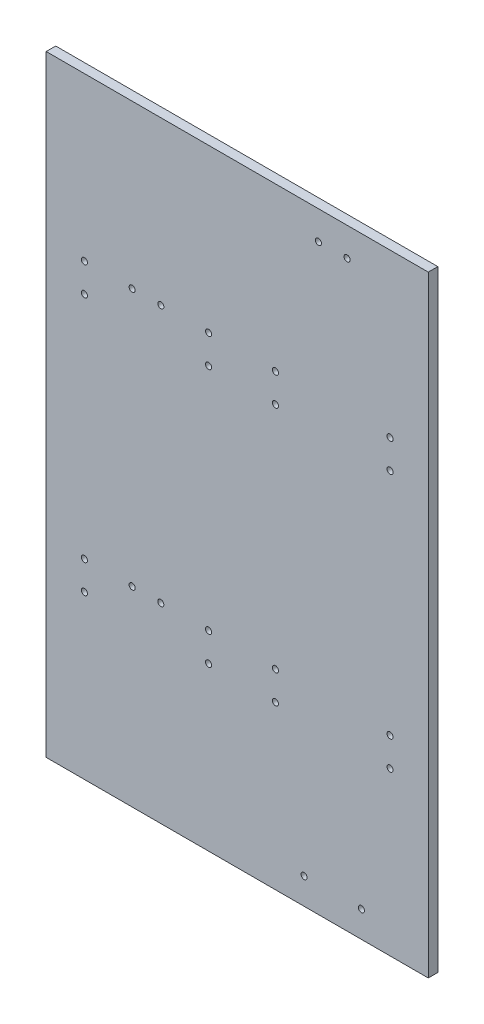
ISO-10303-21;
HEADER;
FILE_DESCRIPTION(('STEP AP214'),'2;1');
FILE_NAME('part.step','',(''),(''),'','','');
FILE_SCHEMA(('AUTOMOTIVE_DESIGN { 1 0 10303 214 1 1 1 1 }'));
ENDSEC;
DATA;
#1=APPLICATION_CONTEXT('core data for automotive mechanical design processes');
#2=APPLICATION_PROTOCOL_DEFINITION('international standard','automotive_design',2000,#1);
#3=PRODUCT_CONTEXT('',#1,'mechanical');
#4=PRODUCT('Part','Part','',(#3));
#5=PRODUCT_RELATED_PRODUCT_CATEGORY('part','',(#4));
#6=PRODUCT_DEFINITION_FORMATION('','',#4);
#7=PRODUCT_DEFINITION_CONTEXT('part definition',#1,'design');
#8=PRODUCT_DEFINITION('design','',#6,#7);
#9=PRODUCT_DEFINITION_SHAPE('','',#8);
#10=(LENGTH_UNIT() NAMED_UNIT(*) SI_UNIT(.MILLI.,.METRE.));
#11=(NAMED_UNIT(*) PLANE_ANGLE_UNIT() SI_UNIT($,.RADIAN.));
#12=(NAMED_UNIT(*) SI_UNIT($,.STERADIAN.) SOLID_ANGLE_UNIT());
#13=UNCERTAINTY_MEASURE_WITH_UNIT(LENGTH_MEASURE(1.E-05),#10,'distance_accuracy_value','');
#14=(GEOMETRIC_REPRESENTATION_CONTEXT(3) GLOBAL_UNCERTAINTY_ASSIGNED_CONTEXT((#13)) GLOBAL_UNIT_ASSIGNED_CONTEXT((#10,
#11,#12)) REPRESENTATION_CONTEXT('',''));
#15=CARTESIAN_POINT('',(0.,0.,0.));
#16=DIRECTION('',(0.,0.,1.));
#17=DIRECTION('',(1.,0.,0.));
#18=AXIS2_PLACEMENT_3D('',#15,#16,#17);
#19=CARTESIAN_POINT('',(100.,-160.,5.));
#20=DIRECTION('',(-1.,0.,0.));
#21=DIRECTION('',(0.,0.,1.));
#22=AXIS2_PLACEMENT_3D('',#19,#20,#21);
#23=PLANE('',#22);
#24=DIRECTION('',(0.,1.,0.));
#25=VECTOR('',#24,1.);
#26=CARTESIAN_POINT('',(100.,-160.,0.));
#27=LINE('',#26,#25);
#28=CARTESIAN_POINT('',(100.,-160.,0.));
#29=VERTEX_POINT('',#28);
#30=CARTESIAN_POINT('',(100.,160.,0.));
#31=VERTEX_POINT('',#30);
#32=EDGE_CURVE('E96',#29,#31,#27,.T.);
#33=ORIENTED_EDGE('',*,*,#32,.T.);
#34=DIRECTION('',(0.,0.,-1.));
#35=VECTOR('',#34,1.);
#36=CARTESIAN_POINT('',(100.,160.,5.));
#37=LINE('',#36,#35);
#38=CARTESIAN_POINT('',(100.,160.,5.));
#39=VERTEX_POINT('',#38);
#40=EDGE_CURVE('E11',#39,#31,#37,.T.);
#41=ORIENTED_EDGE('',*,*,#40,.F.);
#42=DIRECTION('',(0.,1.,0.));
#43=VECTOR('',#42,1.);
#44=CARTESIAN_POINT('',(100.,-160.,5.));
#45=LINE('',#44,#43);
#46=CARTESIAN_POINT('',(100.,-160.,5.));
#47=VERTEX_POINT('',#46);
#48=EDGE_CURVE('E84',#47,#39,#45,.T.);
#49=ORIENTED_EDGE('',*,*,#48,.F.);
#50=DIRECTION('',(0.,0.,-1.));
#51=VECTOR('',#50,1.);
#52=CARTESIAN_POINT('',(100.,-160.,5.));
#53=LINE('',#52,#51);
#54=EDGE_CURVE('E92',#47,#29,#53,.T.);
#55=ORIENTED_EDGE('',*,*,#54,.T.);
#56=EDGE_LOOP('',(#33,#41,#49,#55));
#57=FACE_BOUND('',#56,.T.);
#58=ADVANCED_FACE('F33',(#57),#23,.F.);
#59=CARTESIAN_POINT('',(-100.,160.,5.));
#60=DIRECTION('',(0.,-1.,0.));
#61=DIRECTION('',(0.,0.,-1.));
#62=AXIS2_PLACEMENT_3D('',#59,#60,#61);
#63=PLANE('',#62);
#64=DIRECTION('',(-1.,0.,0.));
#65=VECTOR('',#64,1.);
#66=CARTESIAN_POINT('',(-100.,160.,0.));
#67=LINE('',#66,#65);
#68=CARTESIAN_POINT('',(-100.,160.,0.));
#69=VERTEX_POINT('',#68);
#70=EDGE_CURVE('E88',#31,#69,#67,.T.);
#71=ORIENTED_EDGE('',*,*,#70,.T.);
#72=DIRECTION('',(0.,0.,-1.));
#73=VECTOR('',#72,1.);
#74=CARTESIAN_POINT('',(-100.,160.,5.));
#75=LINE('',#74,#73);
#76=CARTESIAN_POINT('',(-100.,160.,5.));
#77=VERTEX_POINT('',#76);
#78=EDGE_CURVE('E41',#77,#69,#75,.T.);
#79=ORIENTED_EDGE('',*,*,#78,.F.);
#80=DIRECTION('',(-1.,0.,0.));
#81=VECTOR('',#80,1.);
#82=CARTESIAN_POINT('',(-100.,160.,5.));
#83=LINE('',#82,#81);
#84=EDGE_CURVE('E79',#39,#77,#83,.T.);
#85=ORIENTED_EDGE('',*,*,#84,.F.);
#86=ORIENTED_EDGE('',*,*,#40,.T.);
#87=EDGE_LOOP('',(#71,#79,#85,#86));
#88=FACE_BOUND('',#87,.T.);
#89=ADVANCED_FACE('F87',(#88),#63,.F.);
#90=CARTESIAN_POINT('',(-100.,-160.,5.));
#91=DIRECTION('',(1.,0.,0.));
#92=DIRECTION('',(0.,0.,-1.));
#93=AXIS2_PLACEMENT_3D('',#90,#91,#92);
#94=PLANE('',#93);
#95=DIRECTION('',(0.,-1.,0.));
#96=VECTOR('',#95,1.);
#97=CARTESIAN_POINT('',(-100.,-160.,0.));
#98=LINE('',#97,#96);
#99=CARTESIAN_POINT('',(-100.,-160.,0.));
#100=VERTEX_POINT('',#99);
#101=EDGE_CURVE('E66',#69,#100,#98,.T.);
#102=ORIENTED_EDGE('',*,*,#101,.T.);
#103=DIRECTION('',(0.,0.,-1.));
#104=VECTOR('',#103,1.);
#105=CARTESIAN_POINT('',(-100.,-160.,5.));
#106=LINE('',#105,#104);
#107=CARTESIAN_POINT('',(-100.,-160.,5.));
#108=VERTEX_POINT('',#107);
#109=EDGE_CURVE('E89',#108,#100,#106,.T.);
#110=ORIENTED_EDGE('',*,*,#109,.F.);
#111=DIRECTION('',(0.,-1.,0.));
#112=VECTOR('',#111,1.);
#113=CARTESIAN_POINT('',(-100.,-160.,5.));
#114=LINE('',#113,#112);
#115=EDGE_CURVE('E82',#77,#108,#114,.T.);
#116=ORIENTED_EDGE('',*,*,#115,.F.);
#117=ORIENTED_EDGE('',*,*,#78,.T.);
#118=EDGE_LOOP('',(#102,#110,#116,#117));
#119=FACE_BOUND('',#118,.T.);
#120=ADVANCED_FACE('F90',(#119),#94,.F.);
#121=CARTESIAN_POINT('',(-100.,-160.,5.));
#122=DIRECTION('',(0.,1.,0.));
#123=DIRECTION('',(0.,0.,1.));
#124=AXIS2_PLACEMENT_3D('',#121,#122,#123);
#125=PLANE('',#124);
#126=DIRECTION('',(1.,0.,0.));
#127=VECTOR('',#126,1.);
#128=CARTESIAN_POINT('',(-100.,-160.,0.));
#129=LINE('',#128,#127);
#130=EDGE_CURVE('E72',#100,#29,#129,.T.);
#131=ORIENTED_EDGE('',*,*,#130,.T.);
#132=ORIENTED_EDGE('',*,*,#54,.F.);
#133=DIRECTION('',(1.,0.,0.));
#134=VECTOR('',#133,1.);
#135=CARTESIAN_POINT('',(-100.,-160.,5.));
#136=LINE('',#135,#134);
#137=EDGE_CURVE('E49',#108,#47,#136,.T.);
#138=ORIENTED_EDGE('',*,*,#137,.F.);
#139=ORIENTED_EDGE('',*,*,#109,.T.);
#140=EDGE_LOOP('',(#131,#132,#138,#139));
#141=FACE_BOUND('',#140,.T.);
#142=ADVANCED_FACE('F104',(#141),#125,.F.);
#143=CARTESIAN_POINT('',(0.,0.,5.));
#144=DIRECTION('',(0.,0.,-1.));
#145=DIRECTION('',(-1.,0.,0.));
#146=AXIS2_PLACEMENT_3D('',#143,#144,#145);
#147=PLANE('',#146);
#148=CARTESIAN_POINT('',(65.,-146.25,5.));
#149=DIRECTION('',(0.,0.,-1.));
#150=DIRECTION('',(-1.,0.,0.));
#151=AXIS2_PLACEMENT_3D('',#148,#149,#150);
#152=CIRCLE('',#151,1.6);
#153=CARTESIAN_POINT('',(63.4,-146.25,5.));
#154=VERTEX_POINT('',#153);
#155=EDGE_CURVE('E241',#154,#154,#152,.F.);
#156=ORIENTED_EDGE('',*,*,#155,.F.);
#157=EDGE_LOOP('',(#156));
#158=FACE_BOUND('',#157,.T.);
#159=CARTESIAN_POINT('',(35.,-146.25,5.));
#160=DIRECTION('',(0.,0.,-1.));
#161=DIRECTION('',(-1.,0.,0.));
#162=AXIS2_PLACEMENT_3D('',#159,#160,#161);
#163=CIRCLE('',#162,1.6);
#164=CARTESIAN_POINT('',(33.4,-146.25,5.));
#165=VERTEX_POINT('',#164);
#166=EDGE_CURVE('E242',#165,#165,#163,.F.);
#167=ORIENTED_EDGE('',*,*,#166,.F.);
#168=EDGE_LOOP('',(#167));
#169=FACE_BOUND('',#168,.T.);
#170=CARTESIAN_POINT('',(-55.,75.,5.));
#171=DIRECTION('',(0.,0.,-1.));
#172=DIRECTION('',(-1.,0.,0.));
#173=AXIS2_PLACEMENT_3D('',#170,#171,#172);
#174=CIRCLE('',#173,1.6);
#175=CARTESIAN_POINT('',(-56.6,75.,5.));
#176=VERTEX_POINT('',#175);
#177=EDGE_CURVE('E223',#176,#176,#174,.F.);
#178=ORIENTED_EDGE('',*,*,#177,.F.);
#179=EDGE_LOOP('',(#178));
#180=FACE_BOUND('',#179,.T.);
#181=CARTESIAN_POINT('',(-40.,-60.,5.));
#182=DIRECTION('',(0.,0.,-1.));
#183=DIRECTION('',(-1.,0.,0.));
#184=AXIS2_PLACEMENT_3D('',#181,#182,#183);
#185=CIRCLE('',#184,1.6);
#186=CARTESIAN_POINT('',(-41.6,-60.,5.));
#187=VERTEX_POINT('',#186);
#188=EDGE_CURVE('E224',#187,#187,#185,.F.);
#189=ORIENTED_EDGE('',*,*,#188,.F.);
#190=EDGE_LOOP('',(#189));
#191=FACE_BOUND('',#190,.T.);
#192=CARTESIAN_POINT('',(-55.,-60.,5.));
#193=DIRECTION('',(0.,0.,-1.));
#194=DIRECTION('',(-1.,0.,0.));
#195=AXIS2_PLACEMENT_3D('',#192,#193,#194);
#196=CIRCLE('',#195,1.6);
#197=CARTESIAN_POINT('',(-56.6,-60.,5.));
#198=VERTEX_POINT('',#197);
#199=EDGE_CURVE('E231',#198,#198,#196,.F.);
#200=ORIENTED_EDGE('',*,*,#199,.F.);
#201=EDGE_LOOP('',(#200));
#202=FACE_BOUND('',#201,.T.);
#203=CARTESIAN_POINT('',(-40.,75.,5.));
#204=DIRECTION('',(0.,0.,-1.));
#205=DIRECTION('',(-1.,0.,0.));
#206=AXIS2_PLACEMENT_3D('',#203,#204,#205);
#207=CIRCLE('',#206,1.6);
#208=CARTESIAN_POINT('',(-41.6,75.,5.));
#209=VERTEX_POINT('',#208);
#210=EDGE_CURVE('E210',#209,#209,#207,.F.);
#211=ORIENTED_EDGE('',*,*,#210,.F.);
#212=EDGE_LOOP('',(#211));
#213=FACE_BOUND('',#212,.T.);
#214=CARTESIAN_POINT('',(42.5,145.,5.));
#215=DIRECTION('',(0.,0.,1.));
#216=DIRECTION('',(1.,0.,0.));
#217=AXIS2_PLACEMENT_3D('',#214,#215,#216);
#218=CIRCLE('',#217,1.6);
#219=CARTESIAN_POINT('',(44.1,145.,5.));
#220=VERTEX_POINT('',#219);
#221=EDGE_CURVE('E195',#220,#220,#218,.T.);
#222=ORIENTED_EDGE('',*,*,#221,.F.);
#223=EDGE_LOOP('',(#222));
#224=FACE_BOUND('',#223,.T.);
#225=CARTESIAN_POINT('',(57.5,145.,5.));
#226=DIRECTION('',(0.,0.,1.));
#227=DIRECTION('',(-1.,0.,0.));
#228=AXIS2_PLACEMENT_3D('',#225,#226,#227);
#229=CIRCLE('',#228,1.6);
#230=CARTESIAN_POINT('',(55.9,145.,5.));
#231=VERTEX_POINT('',#230);
#232=EDGE_CURVE('E209',#231,#231,#229,.T.);
#233=ORIENTED_EDGE('',*,*,#232,.F.);
#234=EDGE_LOOP('',(#233));
#235=FACE_BOUND('',#234,.T.);
#236=CARTESIAN_POINT('',(-15.,60.,5.));
#237=DIRECTION('',(0.,0.,-1.));
#238=DIRECTION('',(-1.,0.,0.));
#239=AXIS2_PLACEMENT_3D('',#236,#237,#238);
#240=CIRCLE('',#239,1.60000000000001);
#241=CARTESIAN_POINT('',(-16.6,60.,5.));
#242=VERTEX_POINT('',#241);
#243=EDGE_CURVE('E176',#242,#242,#240,.F.);
#244=ORIENTED_EDGE('',*,*,#243,.F.);
#245=EDGE_LOOP('',(#244));
#246=FACE_BOUND('',#245,.T.);
#247=CARTESIAN_POINT('',(-80.,-75.,5.));
#248=DIRECTION('',(0.,0.,-1.));
#249=DIRECTION('',(-1.,0.,0.));
#250=AXIS2_PLACEMENT_3D('',#247,#248,#249);
#251=CIRCLE('',#250,1.59999999999999);
#252=CARTESIAN_POINT('',(-81.6,-75.,5.));
#253=VERTEX_POINT('',#252);
#254=EDGE_CURVE('E171',#253,#253,#251,.F.);
#255=ORIENTED_EDGE('',*,*,#254,.F.);
#256=EDGE_LOOP('',(#255));
#257=FACE_BOUND('',#256,.T.);
#258=CARTESIAN_POINT('',(-80.,-60.,5.));
#259=DIRECTION('',(0.,0.,-1.));
#260=DIRECTION('',(-1.,0.,0.));
#261=AXIS2_PLACEMENT_3D('',#258,#259,#260);
#262=CIRCLE('',#261,1.60000000000001);
#263=CARTESIAN_POINT('',(-81.6,-60.,5.));
#264=VERTEX_POINT('',#263);
#265=EDGE_CURVE('E164',#264,#264,#262,.F.);
#266=ORIENTED_EDGE('',*,*,#265,.F.);
#267=EDGE_LOOP('',(#266));
#268=FACE_BOUND('',#267,.T.);
#269=CARTESIAN_POINT('',(-80.,60.,5.));
#270=DIRECTION('',(0.,0.,-1.));
#271=DIRECTION('',(-1.,0.,0.));
#272=AXIS2_PLACEMENT_3D('',#269,#270,#271);
#273=CIRCLE('',#272,1.60000000000001);
#274=CARTESIAN_POINT('',(-81.6,60.,5.));
#275=VERTEX_POINT('',#274);
#276=EDGE_CURVE('E163',#275,#275,#273,.F.);
#277=ORIENTED_EDGE('',*,*,#276,.F.);
#278=EDGE_LOOP('',(#277));
#279=FACE_BOUND('',#278,.T.);
#280=CARTESIAN_POINT('',(-15.,-75.,5.));
#281=DIRECTION('',(0.,0.,-1.));
#282=DIRECTION('',(-1.,0.,0.));
#283=AXIS2_PLACEMENT_3D('',#280,#281,#282);
#284=CIRCLE('',#283,1.59999999999999);
#285=CARTESIAN_POINT('',(-16.6,-75.,5.));
#286=VERTEX_POINT('',#285);
#287=EDGE_CURVE('E183',#286,#286,#284,.F.);
#288=ORIENTED_EDGE('',*,*,#287,.F.);
#289=EDGE_LOOP('',(#288));
#290=FACE_BOUND('',#289,.T.);
#291=CARTESIAN_POINT('',(-15.,-60.,5.));
#292=DIRECTION('',(0.,0.,-1.));
#293=DIRECTION('',(-1.,0.,0.));
#294=AXIS2_PLACEMENT_3D('',#291,#292,#293);
#295=CIRCLE('',#294,1.60000000000001);
#296=CARTESIAN_POINT('',(-16.6,-60.,5.));
#297=VERTEX_POINT('',#296);
#298=EDGE_CURVE('E196',#297,#297,#295,.F.);
#299=ORIENTED_EDGE('',*,*,#298,.F.);
#300=EDGE_LOOP('',(#299));
#301=FACE_BOUND('',#300,.T.);
#302=CARTESIAN_POINT('',(-15.,75.,5.));
#303=DIRECTION('',(0.,0.,-1.));
#304=DIRECTION('',(-1.,0.,0.));
#305=AXIS2_PLACEMENT_3D('',#302,#303,#304);
#306=CIRCLE('',#305,1.60000000000001);
#307=CARTESIAN_POINT('',(-16.6,75.,5.));
#308=VERTEX_POINT('',#307);
#309=EDGE_CURVE('E188',#308,#308,#306,.F.);
#310=ORIENTED_EDGE('',*,*,#309,.F.);
#311=EDGE_LOOP('',(#310));
#312=FACE_BOUND('',#311,.T.);
#313=CARTESIAN_POINT('',(-80.,75.,5.));
#314=DIRECTION('',(0.,0.,-1.));
#315=DIRECTION('',(-1.,0.,0.));
#316=AXIS2_PLACEMENT_3D('',#313,#314,#315);
#317=CIRCLE('',#316,1.60000000000001);
#318=CARTESIAN_POINT('',(-81.6,75.,5.));
#319=VERTEX_POINT('',#318);
#320=EDGE_CURVE('E147',#319,#319,#317,.F.);
#321=ORIENTED_EDGE('',*,*,#320,.F.);
#322=EDGE_LOOP('',(#321));
#323=FACE_BOUND('',#322,.T.);
#324=CARTESIAN_POINT('',(80.,60.,5.));
#325=DIRECTION('',(0.,0.,-1.));
#326=DIRECTION('',(-1.,0.,0.));
#327=AXIS2_PLACEMENT_3D('',#324,#325,#326);
#328=CIRCLE('',#327,1.60000000000001);
#329=CARTESIAN_POINT('',(78.4,60.,5.));
#330=VERTEX_POINT('',#329);
#331=EDGE_CURVE('E115',#330,#330,#328,.F.);
#332=ORIENTED_EDGE('',*,*,#331,.F.);
#333=EDGE_LOOP('',(#332));
#334=FACE_BOUND('',#333,.T.);
#335=CARTESIAN_POINT('',(80.,-60.,5.));
#336=DIRECTION('',(0.,0.,-1.));
#337=DIRECTION('',(-1.,0.,0.));
#338=AXIS2_PLACEMENT_3D('',#335,#336,#337);
#339=CIRCLE('',#338,1.60000000000001);
#340=CARTESIAN_POINT('',(78.4,-60.,5.));
#341=VERTEX_POINT('',#340);
#342=EDGE_CURVE('E130',#341,#341,#339,.F.);
#343=ORIENTED_EDGE('',*,*,#342,.F.);
#344=EDGE_LOOP('',(#343));
#345=FACE_BOUND('',#344,.T.);
#346=CARTESIAN_POINT('',(80.,-75.,5.));
#347=DIRECTION('',(0.,0.,-1.));
#348=DIRECTION('',(-1.,0.,0.));
#349=AXIS2_PLACEMENT_3D('',#346,#347,#348);
#350=CIRCLE('',#349,1.60000000000001);
#351=CARTESIAN_POINT('',(78.4,-75.,5.));
#352=VERTEX_POINT('',#351);
#353=EDGE_CURVE('E124',#352,#352,#350,.F.);
#354=ORIENTED_EDGE('',*,*,#353,.F.);
#355=EDGE_LOOP('',(#354));
#356=FACE_BOUND('',#355,.T.);
#357=CARTESIAN_POINT('',(20.,-75.,5.));
#358=DIRECTION('',(0.,0.,-1.));
#359=DIRECTION('',(-1.,0.,0.));
#360=AXIS2_PLACEMENT_3D('',#357,#358,#359);
#361=CIRCLE('',#360,1.60000000000001);
#362=CARTESIAN_POINT('',(18.4,-75.,5.));
#363=VERTEX_POINT('',#362);
#364=EDGE_CURVE('E116',#363,#363,#361,.F.);
#365=ORIENTED_EDGE('',*,*,#364,.F.);
#366=EDGE_LOOP('',(#365));
#367=FACE_BOUND('',#366,.T.);
#368=CARTESIAN_POINT('',(20.,-60.,5.));
#369=DIRECTION('',(0.,0.,-1.));
#370=DIRECTION('',(-1.,0.,0.));
#371=AXIS2_PLACEMENT_3D('',#368,#369,#370);
#372=CIRCLE('',#371,1.60000000000001);
#373=CARTESIAN_POINT('',(18.4,-60.,5.));
#374=VERTEX_POINT('',#373);
#375=EDGE_CURVE('E123',#374,#374,#372,.F.);
#376=ORIENTED_EDGE('',*,*,#375,.F.);
#377=EDGE_LOOP('',(#376));
#378=FACE_BOUND('',#377,.T.);
#379=CARTESIAN_POINT('',(20.,60.,5.));
#380=DIRECTION('',(0.,0.,-1.));
#381=DIRECTION('',(-1.,0.,0.));
#382=AXIS2_PLACEMENT_3D('',#379,#380,#381);
#383=CIRCLE('',#382,1.60000000000001);
#384=CARTESIAN_POINT('',(18.4,60.,5.));
#385=VERTEX_POINT('',#384);
#386=EDGE_CURVE('E148',#385,#385,#383,.F.);
#387=ORIENTED_EDGE('',*,*,#386,.F.);
#388=EDGE_LOOP('',(#387));
#389=FACE_BOUND('',#388,.T.);
#390=CARTESIAN_POINT('',(20.,75.,5.));
#391=DIRECTION('',(0.,0.,-1.));
#392=DIRECTION('',(-1.,0.,0.));
#393=AXIS2_PLACEMENT_3D('',#390,#391,#392);
#394=CIRCLE('',#393,1.60000000000001);
#395=CARTESIAN_POINT('',(18.4,75.,5.));
#396=VERTEX_POINT('',#395);
#397=EDGE_CURVE('E140',#396,#396,#394,.F.);
#398=ORIENTED_EDGE('',*,*,#397,.F.);
#399=EDGE_LOOP('',(#398));
#400=FACE_BOUND('',#399,.T.);
#401=CARTESIAN_POINT('',(80.,75.,5.));
#402=DIRECTION('',(0.,0.,-1.));
#403=DIRECTION('',(-1.,0.,0.));
#404=AXIS2_PLACEMENT_3D('',#401,#402,#403);
#405=CIRCLE('',#404,1.60000000000001);
#406=CARTESIAN_POINT('',(78.4,75.,5.));
#407=VERTEX_POINT('',#406);
#408=EDGE_CURVE('E99',#407,#407,#405,.F.);
#409=ORIENTED_EDGE('',*,*,#408,.F.);
#410=EDGE_LOOP('',(#409));
#411=FACE_BOUND('',#410,.T.);
#412=ORIENTED_EDGE('',*,*,#48,.T.);
#413=ORIENTED_EDGE('',*,*,#84,.T.);
#414=ORIENTED_EDGE('',*,*,#115,.T.);
#415=ORIENTED_EDGE('',*,*,#137,.T.);
#416=EDGE_LOOP('',(#412,#413,#414,#415));
#417=FACE_BOUND('',#416,.T.);
#418=ADVANCED_FACE('F80',(#158,#169,#180,#191,#202,#213,#224,#235,#246,#257,#268,#279,#290,#301,
#312,#323,#334,#345,#356,#367,#378,#389,#400,#411,#417),#147,.F.);
#419=CARTESIAN_POINT('',(0.,0.,0.));
#420=DIRECTION('',(0.,0.,-1.));
#421=DIRECTION('',(-1.,0.,0.));
#422=AXIS2_PLACEMENT_3D('',#419,#420,#421);
#423=PLANE('',#422);
#424=CARTESIAN_POINT('',(65.,-146.25,0.));
#425=DIRECTION('',(0.,0.,-1.));
#426=DIRECTION('',(-1.,0.,0.));
#427=AXIS2_PLACEMENT_3D('',#424,#425,#426);
#428=CIRCLE('',#427,1.6);
#429=CARTESIAN_POINT('',(63.4,-146.25,0.));
#430=VERTEX_POINT('',#429);
#431=EDGE_CURVE('E245',#430,#430,#428,.T.);
#432=ORIENTED_EDGE('',*,*,#431,.F.);
#433=EDGE_LOOP('',(#432));
#434=FACE_BOUND('',#433,.T.);
#435=CARTESIAN_POINT('',(35.,-146.25,0.));
#436=DIRECTION('',(0.,0.,-1.));
#437=DIRECTION('',(-1.,0.,0.));
#438=AXIS2_PLACEMENT_3D('',#435,#436,#437);
#439=CIRCLE('',#438,1.6);
#440=CARTESIAN_POINT('',(33.4,-146.25,0.));
#441=VERTEX_POINT('',#440);
#442=EDGE_CURVE('E246',#441,#441,#439,.T.);
#443=ORIENTED_EDGE('',*,*,#442,.F.);
#444=EDGE_LOOP('',(#443));
#445=FACE_BOUND('',#444,.T.);
#446=CARTESIAN_POINT('',(-55.,75.,0.));
#447=DIRECTION('',(0.,0.,-1.));
#448=DIRECTION('',(-1.,0.,0.));
#449=AXIS2_PLACEMENT_3D('',#446,#447,#448);
#450=CIRCLE('',#449,1.6);
#451=CARTESIAN_POINT('',(-56.6,75.,0.));
#452=VERTEX_POINT('',#451);
#453=EDGE_CURVE('E227',#452,#452,#450,.T.);
#454=ORIENTED_EDGE('',*,*,#453,.F.);
#455=EDGE_LOOP('',(#454));
#456=FACE_BOUND('',#455,.T.);
#457=CARTESIAN_POINT('',(-40.,-60.,0.));
#458=DIRECTION('',(0.,0.,-1.));
#459=DIRECTION('',(-1.,0.,0.));
#460=AXIS2_PLACEMENT_3D('',#457,#458,#459);
#461=CIRCLE('',#460,1.6);
#462=CARTESIAN_POINT('',(-41.6,-60.,0.));
#463=VERTEX_POINT('',#462);
#464=EDGE_CURVE('E228',#463,#463,#461,.T.);
#465=ORIENTED_EDGE('',*,*,#464,.F.);
#466=EDGE_LOOP('',(#465));
#467=FACE_BOUND('',#466,.T.);
#468=CARTESIAN_POINT('',(-55.,-60.,0.));
#469=DIRECTION('',(0.,0.,-1.));
#470=DIRECTION('',(-1.,0.,0.));
#471=AXIS2_PLACEMENT_3D('',#468,#469,#470);
#472=CIRCLE('',#471,1.6);
#473=CARTESIAN_POINT('',(-56.6,-60.,0.));
#474=VERTEX_POINT('',#473);
#475=EDGE_CURVE('E238',#474,#474,#472,.T.);
#476=ORIENTED_EDGE('',*,*,#475,.F.);
#477=EDGE_LOOP('',(#476));
#478=FACE_BOUND('',#477,.T.);
#479=CARTESIAN_POINT('',(-40.,75.,0.));
#480=DIRECTION('',(0.,0.,-1.));
#481=DIRECTION('',(-1.,0.,0.));
#482=AXIS2_PLACEMENT_3D('',#479,#480,#481);
#483=CIRCLE('',#482,1.6);
#484=CARTESIAN_POINT('',(-41.6,75.,0.));
#485=VERTEX_POINT('',#484);
#486=EDGE_CURVE('E220',#485,#485,#483,.T.);
#487=ORIENTED_EDGE('',*,*,#486,.F.);
#488=EDGE_LOOP('',(#487));
#489=FACE_BOUND('',#488,.T.);
#490=CARTESIAN_POINT('',(42.5,145.,0.));
#491=DIRECTION('',(0.,0.,-1.));
#492=DIRECTION('',(-1.,0.,0.));
#493=AXIS2_PLACEMENT_3D('',#490,#491,#492);
#494=CIRCLE('',#493,1.6);
#495=CARTESIAN_POINT('',(40.9,145.,0.));
#496=VERTEX_POINT('',#495);
#497=EDGE_CURVE('E213',#496,#496,#494,.F.);
#498=ORIENTED_EDGE('',*,*,#497,.T.);
#499=EDGE_LOOP('',(#498));
#500=FACE_BOUND('',#499,.T.);
#501=CARTESIAN_POINT('',(57.5,145.,0.));
#502=DIRECTION('',(0.,0.,-1.));
#503=DIRECTION('',(-1.,0.,0.));
#504=AXIS2_PLACEMENT_3D('',#501,#502,#503);
#505=CIRCLE('',#504,1.6);
#506=CARTESIAN_POINT('',(55.9,145.,0.));
#507=VERTEX_POINT('',#506);
#508=EDGE_CURVE('E206',#507,#507,#505,.F.);
#509=ORIENTED_EDGE('',*,*,#508,.T.);
#510=EDGE_LOOP('',(#509));
#511=FACE_BOUND('',#510,.T.);
#512=CARTESIAN_POINT('',(-15.,60.,0.));
#513=DIRECTION('',(0.,0.,-1.));
#514=DIRECTION('',(1.,0.,0.));
#515=AXIS2_PLACEMENT_3D('',#512,#513,#514);
#516=CIRCLE('',#515,1.60000000000001);
#517=CARTESIAN_POINT('',(-13.4,60.,0.));
#518=VERTEX_POINT('',#517);
#519=EDGE_CURVE('E180',#518,#518,#516,.T.);
#520=ORIENTED_EDGE('',*,*,#519,.F.);
#521=EDGE_LOOP('',(#520));
#522=FACE_BOUND('',#521,.T.);
#523=CARTESIAN_POINT('',(-80.,-75.,0.));
#524=DIRECTION('',(0.,0.,-1.));
#525=DIRECTION('',(1.,0.,0.));
#526=AXIS2_PLACEMENT_3D('',#523,#524,#525);
#527=CIRCLE('',#526,1.59999999999999);
#528=CARTESIAN_POINT('',(-78.4,-75.,0.));
#529=VERTEX_POINT('',#528);
#530=EDGE_CURVE('E179',#529,#529,#527,.T.);
#531=ORIENTED_EDGE('',*,*,#530,.F.);
#532=EDGE_LOOP('',(#531));
#533=FACE_BOUND('',#532,.T.);
#534=CARTESIAN_POINT('',(-80.,-60.,0.));
#535=DIRECTION('',(0.,0.,-1.));
#536=DIRECTION('',(1.,0.,0.));
#537=AXIS2_PLACEMENT_3D('',#534,#535,#536);
#538=CIRCLE('',#537,1.60000000000001);
#539=CARTESIAN_POINT('',(-78.4,-60.,0.));
#540=VERTEX_POINT('',#539);
#541=EDGE_CURVE('E168',#540,#540,#538,.T.);
#542=ORIENTED_EDGE('',*,*,#541,.F.);
#543=EDGE_LOOP('',(#542));
#544=FACE_BOUND('',#543,.T.);
#545=CARTESIAN_POINT('',(-80.,60.,0.));
#546=DIRECTION('',(0.,0.,-1.));
#547=DIRECTION('',(-1.,0.,0.));
#548=AXIS2_PLACEMENT_3D('',#545,#546,#547);
#549=CIRCLE('',#548,1.60000000000001);
#550=CARTESIAN_POINT('',(-81.6,60.,0.));
#551=VERTEX_POINT('',#550);
#552=EDGE_CURVE('E167',#551,#551,#549,.T.);
#553=ORIENTED_EDGE('',*,*,#552,.F.);
#554=EDGE_LOOP('',(#553));
#555=FACE_BOUND('',#554,.T.);
#556=CARTESIAN_POINT('',(-15.,-75.,0.));
#557=DIRECTION('',(0.,0.,-1.));
#558=DIRECTION('',(-1.,0.,0.));
#559=AXIS2_PLACEMENT_3D('',#556,#557,#558);
#560=CIRCLE('',#559,1.59999999999999);
#561=CARTESIAN_POINT('',(-16.6,-75.,0.));
#562=VERTEX_POINT('',#561);
#563=EDGE_CURVE('E199',#562,#562,#560,.T.);
#564=ORIENTED_EDGE('',*,*,#563,.F.);
#565=EDGE_LOOP('',(#564));
#566=FACE_BOUND('',#565,.T.);
#567=CARTESIAN_POINT('',(-15.,-60.,0.));
#568=DIRECTION('',(0.,0.,-1.));
#569=DIRECTION('',(-1.,0.,0.));
#570=AXIS2_PLACEMENT_3D('',#567,#568,#569);
#571=CIRCLE('',#570,1.60000000000001);
#572=CARTESIAN_POINT('',(-16.6,-60.,0.));
#573=VERTEX_POINT('',#572);
#574=EDGE_CURVE('E191',#573,#573,#571,.T.);
#575=ORIENTED_EDGE('',*,*,#574,.F.);
#576=EDGE_LOOP('',(#575));
#577=FACE_BOUND('',#576,.T.);
#578=CARTESIAN_POINT('',(-15.,75.,0.));
#579=DIRECTION('',(0.,0.,-1.));
#580=DIRECTION('',(1.,0.,0.));
#581=AXIS2_PLACEMENT_3D('',#578,#579,#580);
#582=CIRCLE('',#581,1.60000000000001);
#583=CARTESIAN_POINT('',(-13.4,75.,0.));
#584=VERTEX_POINT('',#583);
#585=EDGE_CURVE('E192',#584,#584,#582,.T.);
#586=ORIENTED_EDGE('',*,*,#585,.F.);
#587=EDGE_LOOP('',(#586));
#588=FACE_BOUND('',#587,.T.);
#589=CARTESIAN_POINT('',(-80.,75.,0.));
#590=DIRECTION('',(0.,0.,-1.));
#591=DIRECTION('',(-1.,0.,0.));
#592=AXIS2_PLACEMENT_3D('',#589,#590,#591);
#593=CIRCLE('',#592,1.60000000000001);
#594=CARTESIAN_POINT('',(-81.6,75.,0.));
#595=VERTEX_POINT('',#594);
#596=EDGE_CURVE('E160',#595,#595,#593,.T.);
#597=ORIENTED_EDGE('',*,*,#596,.F.);
#598=EDGE_LOOP('',(#597));
#599=FACE_BOUND('',#598,.T.);
#600=CARTESIAN_POINT('',(80.,60.,0.));
#601=DIRECTION('',(0.,0.,-1.));
#602=DIRECTION('',(-1.,0.,0.));
#603=AXIS2_PLACEMENT_3D('',#600,#601,#602);
#604=CIRCLE('',#603,1.60000000000001);
#605=CARTESIAN_POINT('',(78.4,60.,0.));
#606=VERTEX_POINT('',#605);
#607=EDGE_CURVE('E133',#606,#606,#604,.T.);
#608=ORIENTED_EDGE('',*,*,#607,.F.);
#609=EDGE_LOOP('',(#608));
#610=FACE_BOUND('',#609,.T.);
#611=CARTESIAN_POINT('',(80.,-60.,0.));
#612=DIRECTION('',(0.,0.,-1.));
#613=DIRECTION('',(1.,0.,0.));
#614=AXIS2_PLACEMENT_3D('',#611,#612,#613);
#615=CIRCLE('',#614,1.60000000000001);
#616=CARTESIAN_POINT('',(81.6,-60.,0.));
#617=VERTEX_POINT('',#616);
#618=EDGE_CURVE('E127',#617,#617,#615,.T.);
#619=ORIENTED_EDGE('',*,*,#618,.F.);
#620=EDGE_LOOP('',(#619));
#621=FACE_BOUND('',#620,.T.);
#622=CARTESIAN_POINT('',(80.,-75.,0.));
#623=DIRECTION('',(0.,0.,-1.));
#624=DIRECTION('',(1.,0.,0.));
#625=AXIS2_PLACEMENT_3D('',#622,#623,#624);
#626=CIRCLE('',#625,1.60000000000001);
#627=CARTESIAN_POINT('',(81.6,-75.,0.));
#628=VERTEX_POINT('',#627);
#629=EDGE_CURVE('E119',#628,#628,#626,.T.);
#630=ORIENTED_EDGE('',*,*,#629,.F.);
#631=EDGE_LOOP('',(#630));
#632=FACE_BOUND('',#631,.T.);
#633=CARTESIAN_POINT('',(20.,-75.,0.));
#634=DIRECTION('',(0.,0.,-1.));
#635=DIRECTION('',(-1.,0.,0.));
#636=AXIS2_PLACEMENT_3D('',#633,#634,#635);
#637=CIRCLE('',#636,1.60000000000001);
#638=CARTESIAN_POINT('',(18.4,-75.,0.));
#639=VERTEX_POINT('',#638);
#640=EDGE_CURVE('E120',#639,#639,#637,.T.);
#641=ORIENTED_EDGE('',*,*,#640,.F.);
#642=EDGE_LOOP('',(#641));
#643=FACE_BOUND('',#642,.T.);
#644=CARTESIAN_POINT('',(20.,-60.,0.));
#645=DIRECTION('',(0.,0.,-1.));
#646=DIRECTION('',(-1.,0.,0.));
#647=AXIS2_PLACEMENT_3D('',#644,#645,#646);
#648=CIRCLE('',#647,1.60000000000001);
#649=CARTESIAN_POINT('',(18.4,-60.,0.));
#650=VERTEX_POINT('',#649);
#651=EDGE_CURVE('E151',#650,#650,#648,.T.);
#652=ORIENTED_EDGE('',*,*,#651,.F.);
#653=EDGE_LOOP('',(#652));
#654=FACE_BOUND('',#653,.T.);
#655=CARTESIAN_POINT('',(20.,60.,0.));
#656=DIRECTION('',(0.,0.,-1.));
#657=DIRECTION('',(1.,0.,0.));
#658=AXIS2_PLACEMENT_3D('',#655,#656,#657);
#659=CIRCLE('',#658,1.60000000000001);
#660=CARTESIAN_POINT('',(21.6,60.,0.));
#661=VERTEX_POINT('',#660);
#662=EDGE_CURVE('E143',#661,#661,#659,.T.);
#663=ORIENTED_EDGE('',*,*,#662,.F.);
#664=EDGE_LOOP('',(#663));
#665=FACE_BOUND('',#664,.T.);
#666=CARTESIAN_POINT('',(20.,75.,0.));
#667=DIRECTION('',(0.,0.,-1.));
#668=DIRECTION('',(1.,0.,0.));
#669=AXIS2_PLACEMENT_3D('',#666,#667,#668);
#670=CIRCLE('',#669,1.60000000000001);
#671=CARTESIAN_POINT('',(21.6,75.,0.));
#672=VERTEX_POINT('',#671);
#673=EDGE_CURVE('E144',#672,#672,#670,.T.);
#674=ORIENTED_EDGE('',*,*,#673,.F.);
#675=EDGE_LOOP('',(#674));
#676=FACE_BOUND('',#675,.T.);
#677=CARTESIAN_POINT('',(80.,75.,0.));
#678=DIRECTION('',(0.,0.,-1.));
#679=DIRECTION('',(-1.,0.,0.));
#680=AXIS2_PLACEMENT_3D('',#677,#678,#679);
#681=CIRCLE('',#680,1.60000000000001);
#682=CARTESIAN_POINT('',(78.4,75.,0.));
#683=VERTEX_POINT('',#682);
#684=EDGE_CURVE('E112',#683,#683,#681,.T.);
#685=ORIENTED_EDGE('',*,*,#684,.F.);
#686=EDGE_LOOP('',(#685));
#687=FACE_BOUND('',#686,.T.);
#688=ORIENTED_EDGE('',*,*,#32,.F.);
#689=ORIENTED_EDGE('',*,*,#130,.F.);
#690=ORIENTED_EDGE('',*,*,#101,.F.);
#691=ORIENTED_EDGE('',*,*,#70,.F.);
#692=EDGE_LOOP('',(#688,#689,#690,#691));
#693=FACE_BOUND('',#692,.T.);
#694=ADVANCED_FACE('F107',(#434,#445,#456,#467,#478,#489,#500,#511,#522,#533,#544,#555,#566,
#577,#588,#599,#610,#621,#632,#643,#654,#665,#676,#687,#693),#423,.T.);
#695=CARTESIAN_POINT('',(80.,75.,5.001));
#696=DIRECTION('',(0.,0.,-1.));
#697=DIRECTION('',(-1.,0.,0.));
#698=AXIS2_PLACEMENT_3D('',#695,#696,#697);
#699=CYLINDRICAL_SURFACE('',#698,1.60000000000001);
#700=ORIENTED_EDGE('',*,*,#684,.T.);
#701=EDGE_LOOP('',(#700));
#702=FACE_BOUND('',#701,.T.);
#703=ORIENTED_EDGE('',*,*,#408,.T.);
#704=EDGE_LOOP('',(#703));
#705=FACE_BOUND('',#704,.T.);
#706=ADVANCED_FACE('F259',(#702,#705),#699,.F.);
#707=CARTESIAN_POINT('',(20.,75.,5.001));
#708=DIRECTION('',(0.,0.,-1.));
#709=DIRECTION('',(-1.,0.,0.));
#710=AXIS2_PLACEMENT_3D('',#707,#708,#709);
#711=CYLINDRICAL_SURFACE('',#710,1.60000000000001);
#712=ORIENTED_EDGE('',*,*,#673,.T.);
#713=EDGE_LOOP('',(#712));
#714=FACE_BOUND('',#713,.T.);
#715=ORIENTED_EDGE('',*,*,#397,.T.);
#716=EDGE_LOOP('',(#715));
#717=FACE_BOUND('',#716,.T.);
#718=ADVANCED_FACE('F309',(#714,#717),#711,.F.);
#719=CARTESIAN_POINT('',(20.,60.,5.001));
#720=DIRECTION('',(0.,0.,-1.));
#721=DIRECTION('',(-1.,0.,0.));
#722=AXIS2_PLACEMENT_3D('',#719,#720,#721);
#723=CYLINDRICAL_SURFACE('',#722,1.60000000000001);
#724=ORIENTED_EDGE('',*,*,#662,.T.);
#725=EDGE_LOOP('',(#724));
#726=FACE_BOUND('',#725,.T.);
#727=ORIENTED_EDGE('',*,*,#386,.T.);
#728=EDGE_LOOP('',(#727));
#729=FACE_BOUND('',#728,.T.);
#730=ADVANCED_FACE('F358',(#726,#729),#723,.F.);
#731=CARTESIAN_POINT('',(20.,-60.,5.001));
#732=DIRECTION('',(0.,0.,-1.));
#733=DIRECTION('',(-1.,0.,0.));
#734=AXIS2_PLACEMENT_3D('',#731,#732,#733);
#735=CYLINDRICAL_SURFACE('',#734,1.60000000000001);
#736=ORIENTED_EDGE('',*,*,#651,.T.);
#737=EDGE_LOOP('',(#736));
#738=FACE_BOUND('',#737,.T.);
#739=ORIENTED_EDGE('',*,*,#375,.T.);
#740=EDGE_LOOP('',(#739));
#741=FACE_BOUND('',#740,.T.);
#742=ADVANCED_FACE('F366',(#738,#741),#735,.F.);
#743=CARTESIAN_POINT('',(20.,-75.,5.001));
#744=DIRECTION('',(0.,0.,-1.));
#745=DIRECTION('',(-1.,0.,0.));
#746=AXIS2_PLACEMENT_3D('',#743,#744,#745);
#747=CYLINDRICAL_SURFACE('',#746,1.60000000000001);
#748=ORIENTED_EDGE('',*,*,#640,.T.);
#749=EDGE_LOOP('',(#748));
#750=FACE_BOUND('',#749,.T.);
#751=ORIENTED_EDGE('',*,*,#364,.T.);
#752=EDGE_LOOP('',(#751));
#753=FACE_BOUND('',#752,.T.);
#754=ADVANCED_FACE('F374',(#750,#753),#747,.F.);
#755=CARTESIAN_POINT('',(80.,-75.,5.001));
#756=DIRECTION('',(0.,0.,-1.));
#757=DIRECTION('',(-1.,0.,0.));
#758=AXIS2_PLACEMENT_3D('',#755,#756,#757);
#759=CYLINDRICAL_SURFACE('',#758,1.60000000000001);
#760=ORIENTED_EDGE('',*,*,#629,.T.);
#761=EDGE_LOOP('',(#760));
#762=FACE_BOUND('',#761,.T.);
#763=ORIENTED_EDGE('',*,*,#353,.T.);
#764=EDGE_LOOP('',(#763));
#765=FACE_BOUND('',#764,.T.);
#766=ADVANCED_FACE('F382',(#762,#765),#759,.F.);
#767=CARTESIAN_POINT('',(80.,-60.,5.001));
#768=DIRECTION('',(0.,0.,-1.));
#769=DIRECTION('',(-1.,0.,0.));
#770=AXIS2_PLACEMENT_3D('',#767,#768,#769);
#771=CYLINDRICAL_SURFACE('',#770,1.60000000000001);
#772=ORIENTED_EDGE('',*,*,#618,.T.);
#773=EDGE_LOOP('',(#772));
#774=FACE_BOUND('',#773,.T.);
#775=ORIENTED_EDGE('',*,*,#342,.T.);
#776=EDGE_LOOP('',(#775));
#777=FACE_BOUND('',#776,.T.);
#778=ADVANCED_FACE('F390',(#774,#777),#771,.F.);
#779=CARTESIAN_POINT('',(80.,60.,5.001));
#780=DIRECTION('',(0.,0.,-1.));
#781=DIRECTION('',(-1.,0.,0.));
#782=AXIS2_PLACEMENT_3D('',#779,#780,#781);
#783=CYLINDRICAL_SURFACE('',#782,1.60000000000001);
#784=ORIENTED_EDGE('',*,*,#607,.T.);
#785=EDGE_LOOP('',(#784));
#786=FACE_BOUND('',#785,.T.);
#787=ORIENTED_EDGE('',*,*,#331,.T.);
#788=EDGE_LOOP('',(#787));
#789=FACE_BOUND('',#788,.T.);
#790=ADVANCED_FACE('F398',(#786,#789),#783,.F.);
#791=CARTESIAN_POINT('',(-80.,75.,5.001));
#792=DIRECTION('',(0.,0.,-1.));
#793=DIRECTION('',(-1.,0.,0.));
#794=AXIS2_PLACEMENT_3D('',#791,#792,#793);
#795=CYLINDRICAL_SURFACE('',#794,1.60000000000001);
#796=ORIENTED_EDGE('',*,*,#596,.T.);
#797=EDGE_LOOP('',(#796));
#798=FACE_BOUND('',#797,.T.);
#799=ORIENTED_EDGE('',*,*,#320,.T.);
#800=EDGE_LOOP('',(#799));
#801=FACE_BOUND('',#800,.T.);
#802=ADVANCED_FACE('F406',(#798,#801),#795,.F.);
#803=CARTESIAN_POINT('',(-15.,75.,5.001));
#804=DIRECTION('',(0.,0.,-1.));
#805=DIRECTION('',(-1.,0.,0.));
#806=AXIS2_PLACEMENT_3D('',#803,#804,#805);
#807=CYLINDRICAL_SURFACE('',#806,1.60000000000001);
#808=ORIENTED_EDGE('',*,*,#585,.T.);
#809=EDGE_LOOP('',(#808));
#810=FACE_BOUND('',#809,.T.);
#811=ORIENTED_EDGE('',*,*,#309,.T.);
#812=EDGE_LOOP('',(#811));
#813=FACE_BOUND('',#812,.T.);
#814=ADVANCED_FACE('F414',(#810,#813),#807,.F.);
#815=CARTESIAN_POINT('',(-15.,-60.,5.001));
#816=DIRECTION('',(0.,0.,-1.));
#817=DIRECTION('',(-1.,0.,0.));
#818=AXIS2_PLACEMENT_3D('',#815,#816,#817);
#819=CYLINDRICAL_SURFACE('',#818,1.60000000000001);
#820=ORIENTED_EDGE('',*,*,#574,.T.);
#821=EDGE_LOOP('',(#820));
#822=FACE_BOUND('',#821,.T.);
#823=ORIENTED_EDGE('',*,*,#298,.T.);
#824=EDGE_LOOP('',(#823));
#825=FACE_BOUND('',#824,.T.);
#826=ADVANCED_FACE('F422',(#822,#825),#819,.F.);
#827=CARTESIAN_POINT('',(-15.,-75.,5.001));
#828=DIRECTION('',(0.,0.,-1.));
#829=DIRECTION('',(-1.,0.,0.));
#830=AXIS2_PLACEMENT_3D('',#827,#828,#829);
#831=CYLINDRICAL_SURFACE('',#830,1.59999999999999);
#832=ORIENTED_EDGE('',*,*,#563,.T.);
#833=EDGE_LOOP('',(#832));
#834=FACE_BOUND('',#833,.T.);
#835=ORIENTED_EDGE('',*,*,#287,.T.);
#836=EDGE_LOOP('',(#835));
#837=FACE_BOUND('',#836,.T.);
#838=ADVANCED_FACE('F430',(#834,#837),#831,.F.);
#839=CARTESIAN_POINT('',(-80.,60.,5.001));
#840=DIRECTION('',(0.,0.,-1.));
#841=DIRECTION('',(-1.,0.,0.));
#842=AXIS2_PLACEMENT_3D('',#839,#840,#841);
#843=CYLINDRICAL_SURFACE('',#842,1.60000000000001);
#844=ORIENTED_EDGE('',*,*,#552,.T.);
#845=EDGE_LOOP('',(#844));
#846=FACE_BOUND('',#845,.T.);
#847=ORIENTED_EDGE('',*,*,#276,.T.);
#848=EDGE_LOOP('',(#847));
#849=FACE_BOUND('',#848,.T.);
#850=ADVANCED_FACE('F438',(#846,#849),#843,.F.);
#851=CARTESIAN_POINT('',(-80.,-60.,5.001));
#852=DIRECTION('',(0.,0.,-1.));
#853=DIRECTION('',(-1.,0.,0.));
#854=AXIS2_PLACEMENT_3D('',#851,#852,#853);
#855=CYLINDRICAL_SURFACE('',#854,1.60000000000001);
#856=ORIENTED_EDGE('',*,*,#541,.T.);
#857=EDGE_LOOP('',(#856));
#858=FACE_BOUND('',#857,.T.);
#859=ORIENTED_EDGE('',*,*,#265,.T.);
#860=EDGE_LOOP('',(#859));
#861=FACE_BOUND('',#860,.T.);
#862=ADVANCED_FACE('F446',(#858,#861),#855,.F.);
#863=CARTESIAN_POINT('',(-80.,-75.,5.001));
#864=DIRECTION('',(0.,0.,-1.));
#865=DIRECTION('',(-1.,0.,0.));
#866=AXIS2_PLACEMENT_3D('',#863,#864,#865);
#867=CYLINDRICAL_SURFACE('',#866,1.59999999999999);
#868=ORIENTED_EDGE('',*,*,#530,.T.);
#869=EDGE_LOOP('',(#868));
#870=FACE_BOUND('',#869,.T.);
#871=ORIENTED_EDGE('',*,*,#254,.T.);
#872=EDGE_LOOP('',(#871));
#873=FACE_BOUND('',#872,.T.);
#874=ADVANCED_FACE('F454',(#870,#873),#867,.F.);
#875=CARTESIAN_POINT('',(-15.,60.,5.001));
#876=DIRECTION('',(0.,0.,-1.));
#877=DIRECTION('',(-1.,0.,0.));
#878=AXIS2_PLACEMENT_3D('',#875,#876,#877);
#879=CYLINDRICAL_SURFACE('',#878,1.60000000000001);
#880=ORIENTED_EDGE('',*,*,#519,.T.);
#881=EDGE_LOOP('',(#880));
#882=FACE_BOUND('',#881,.T.);
#883=ORIENTED_EDGE('',*,*,#243,.T.);
#884=EDGE_LOOP('',(#883));
#885=FACE_BOUND('',#884,.T.);
#886=ADVANCED_FACE('F462',(#882,#885),#879,.F.);
#887=CARTESIAN_POINT('',(57.5,145.,-0.00100000000000013));
#888=DIRECTION('',(0.,0.,1.));
#889=DIRECTION('',(1.,0.,0.));
#890=AXIS2_PLACEMENT_3D('',#887,#888,#889);
#891=CYLINDRICAL_SURFACE('',#890,1.6);
#892=ORIENTED_EDGE('',*,*,#508,.F.);
#893=EDGE_LOOP('',(#892));
#894=FACE_BOUND('',#893,.T.);
#895=ORIENTED_EDGE('',*,*,#232,.T.);
#896=EDGE_LOOP('',(#895));
#897=FACE_BOUND('',#896,.T.);
#898=ADVANCED_FACE('F470',(#894,#897),#891,.F.);
#899=CARTESIAN_POINT('',(42.5,145.,-0.00100000000000013));
#900=DIRECTION('',(0.,0.,1.));
#901=DIRECTION('',(1.,0.,0.));
#902=AXIS2_PLACEMENT_3D('',#899,#900,#901);
#903=CYLINDRICAL_SURFACE('',#902,1.6);
#904=ORIENTED_EDGE('',*,*,#497,.F.);
#905=EDGE_LOOP('',(#904));
#906=FACE_BOUND('',#905,.T.);
#907=ORIENTED_EDGE('',*,*,#221,.T.);
#908=EDGE_LOOP('',(#907));
#909=FACE_BOUND('',#908,.T.);
#910=ADVANCED_FACE('F478',(#906,#909),#903,.F.);
#911=CARTESIAN_POINT('',(-40.,75.,5.001));
#912=DIRECTION('',(0.,0.,-1.));
#913=DIRECTION('',(-1.,0.,0.));
#914=AXIS2_PLACEMENT_3D('',#911,#912,#913);
#915=CYLINDRICAL_SURFACE('',#914,1.6);
#916=ORIENTED_EDGE('',*,*,#486,.T.);
#917=EDGE_LOOP('',(#916));
#918=FACE_BOUND('',#917,.T.);
#919=ORIENTED_EDGE('',*,*,#210,.T.);
#920=EDGE_LOOP('',(#919));
#921=FACE_BOUND('',#920,.T.);
#922=ADVANCED_FACE('F486',(#918,#921),#915,.F.);
#923=CARTESIAN_POINT('',(-55.,-60.,5.001));
#924=DIRECTION('',(0.,0.,-1.));
#925=DIRECTION('',(-1.,0.,0.));
#926=AXIS2_PLACEMENT_3D('',#923,#924,#925);
#927=CYLINDRICAL_SURFACE('',#926,1.6);
#928=ORIENTED_EDGE('',*,*,#475,.T.);
#929=EDGE_LOOP('',(#928));
#930=FACE_BOUND('',#929,.T.);
#931=ORIENTED_EDGE('',*,*,#199,.T.);
#932=EDGE_LOOP('',(#931));
#933=FACE_BOUND('',#932,.T.);
#934=ADVANCED_FACE('F494',(#930,#933),#927,.F.);
#935=CARTESIAN_POINT('',(-40.,-60.,5.001));
#936=DIRECTION('',(0.,0.,-1.));
#937=DIRECTION('',(-1.,0.,0.));
#938=AXIS2_PLACEMENT_3D('',#935,#936,#937);
#939=CYLINDRICAL_SURFACE('',#938,1.6);
#940=ORIENTED_EDGE('',*,*,#464,.T.);
#941=EDGE_LOOP('',(#940));
#942=FACE_BOUND('',#941,.T.);
#943=ORIENTED_EDGE('',*,*,#188,.T.);
#944=EDGE_LOOP('',(#943));
#945=FACE_BOUND('',#944,.T.);
#946=ADVANCED_FACE('F502',(#942,#945),#939,.F.);
#947=CARTESIAN_POINT('',(-55.,75.,5.001));
#948=DIRECTION('',(0.,0.,-1.));
#949=DIRECTION('',(-1.,0.,0.));
#950=AXIS2_PLACEMENT_3D('',#947,#948,#949);
#951=CYLINDRICAL_SURFACE('',#950,1.6);
#952=ORIENTED_EDGE('',*,*,#453,.T.);
#953=EDGE_LOOP('',(#952));
#954=FACE_BOUND('',#953,.T.);
#955=ORIENTED_EDGE('',*,*,#177,.T.);
#956=EDGE_LOOP('',(#955));
#957=FACE_BOUND('',#956,.T.);
#958=ADVANCED_FACE('F510',(#954,#957),#951,.F.);
#959=CARTESIAN_POINT('',(35.,-146.25,5.001));
#960=DIRECTION('',(0.,0.,-1.));
#961=DIRECTION('',(-1.,0.,0.));
#962=AXIS2_PLACEMENT_3D('',#959,#960,#961);
#963=CYLINDRICAL_SURFACE('',#962,1.6);
#964=ORIENTED_EDGE('',*,*,#442,.T.);
#965=EDGE_LOOP('',(#964));
#966=FACE_BOUND('',#965,.T.);
#967=ORIENTED_EDGE('',*,*,#166,.T.);
#968=EDGE_LOOP('',(#967));
#969=FACE_BOUND('',#968,.T.);
#970=ADVANCED_FACE('F517',(#966,#969),#963,.F.);
#971=CARTESIAN_POINT('',(65.,-146.25,5.001));
#972=DIRECTION('',(0.,0.,-1.));
#973=DIRECTION('',(-1.,0.,0.));
#974=AXIS2_PLACEMENT_3D('',#971,#972,#973);
#975=CYLINDRICAL_SURFACE('',#974,1.6);
#976=ORIENTED_EDGE('',*,*,#431,.T.);
#977=EDGE_LOOP('',(#976));
#978=FACE_BOUND('',#977,.T.);
#979=ORIENTED_EDGE('',*,*,#155,.T.);
#980=EDGE_LOOP('',(#979));
#981=FACE_BOUND('',#980,.T.);
#982=ADVANCED_FACE('F254',(#978,#981),#975,.F.);
#983=CLOSED_SHELL('',(#58,#89,#120,#142,#418,#694,#706,#718,#730,#742,#754,#766,#778,#790,#802,
#814,#826,#838,#850,#862,#874,#886,#898,#910,#922,#934,#946,#958,#970,#982));
#984=MANIFOLD_SOLID_BREP('B2',#983);
#985=ADVANCED_BREP_SHAPE_REPRESENTATION('',(#18,#984),#14);
#986=SHAPE_DEFINITION_REPRESENTATION(#9,#985);
ENDSEC;
END-ISO-10303-21;
